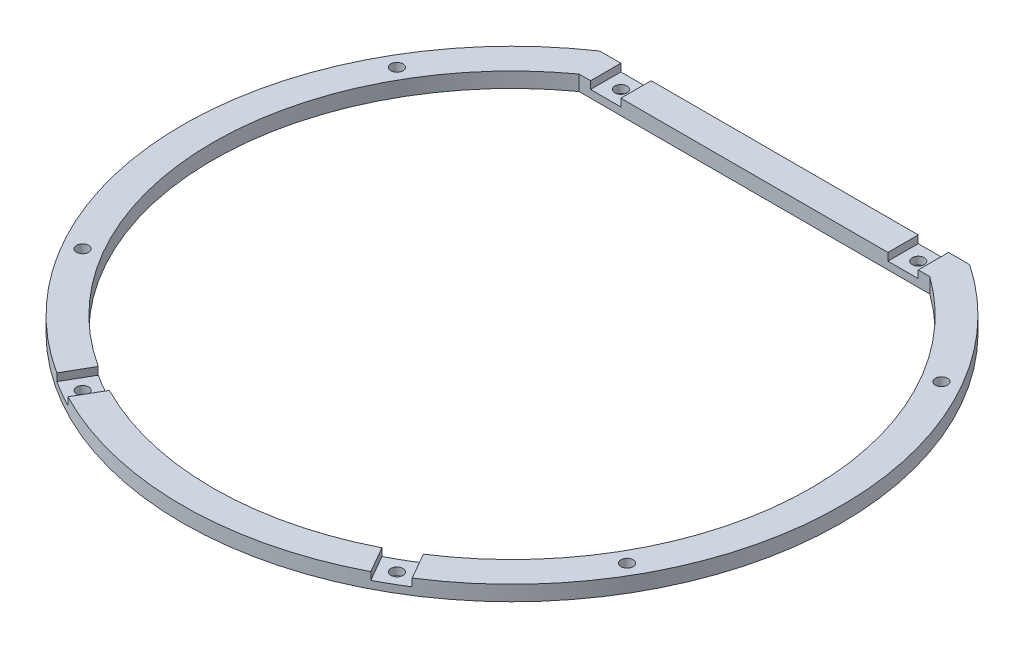
ISO-10303-21;
HEADER;
FILE_DESCRIPTION(('STEP AP214'),'2;1');
FILE_NAME('part.step','',(''),(''),'','','');
FILE_SCHEMA(('AUTOMOTIVE_DESIGN { 1 0 10303 214 1 1 1 1 }'));
ENDSEC;
DATA;
#1=APPLICATION_CONTEXT('core data for automotive mechanical design processes');
#2=APPLICATION_PROTOCOL_DEFINITION('international standard','automotive_design',2000,#1);
#3=PRODUCT_CONTEXT('',#1,'mechanical');
#4=PRODUCT('Part','Part','',(#3));
#5=PRODUCT_RELATED_PRODUCT_CATEGORY('part','',(#4));
#6=PRODUCT_DEFINITION_FORMATION('','',#4);
#7=PRODUCT_DEFINITION_CONTEXT('part definition',#1,'design');
#8=PRODUCT_DEFINITION('design','',#6,#7);
#9=PRODUCT_DEFINITION_SHAPE('','',#8);
#10=(LENGTH_UNIT() NAMED_UNIT(*) SI_UNIT(.MILLI.,.METRE.));
#11=(NAMED_UNIT(*) PLANE_ANGLE_UNIT() SI_UNIT($,.RADIAN.));
#12=(NAMED_UNIT(*) SI_UNIT($,.STERADIAN.) SOLID_ANGLE_UNIT());
#13=UNCERTAINTY_MEASURE_WITH_UNIT(LENGTH_MEASURE(1.E-05),#10,'distance_accuracy_value','');
#14=(GEOMETRIC_REPRESENTATION_CONTEXT(3) GLOBAL_UNCERTAINTY_ASSIGNED_CONTEXT((#13)) GLOBAL_UNIT_ASSIGNED_CONTEXT((#10,
#11,#12)) REPRESENTATION_CONTEXT('',''));
#15=CARTESIAN_POINT('',(0.,0.,0.));
#16=DIRECTION('',(0.,0.,1.));
#17=DIRECTION('',(1.,0.,0.));
#18=AXIS2_PLACEMENT_3D('',#15,#16,#17);
#19=CARTESIAN_POINT('',(0.,4.,0.));
#20=DIRECTION('',(0.,1.,0.));
#21=DIRECTION('',(0.,0.,1.));
#22=AXIS2_PLACEMENT_3D('',#19,#20,#21);
#23=PLANE('',#22);
#24=CARTESIAN_POINT('',(0.,4.,0.));
#25=DIRECTION('',(0.,1.,0.));
#26=DIRECTION('',(0.,0.,1.));
#27=AXIS2_PLACEMENT_3D('',#24,#25,#26);
#28=CIRCLE('',#27,87.);
#29=CARTESIAN_POINT('',(-39.9898970501174,4.,77.2645334802522));
#30=VERTEX_POINT('',#29);
#31=CARTESIAN_POINT('',(39.9898970501174,4.,77.2645334802522));
#32=VERTEX_POINT('',#31);
#33=EDGE_CURVE('E228',#30,#32,#28,.T.);
#34=ORIENTED_EDGE('',*,*,#33,.T.);
#35=DIRECTION('',(-0.5,0.,-0.866025403784439));
#36=VECTOR('',#35,1.);
#37=CARTESIAN_POINT('',(27.5180265038248,4.,55.6626200286515));
#38=LINE('',#37,#36);
#39=CARTESIAN_POINT('',(35.985232980011,4.,70.3282518435823));
#40=VERTEX_POINT('',#39);
#41=EDGE_CURVE('E181',#32,#40,#38,.T.);
#42=ORIENTED_EDGE('',*,*,#41,.T.);
#43=CARTESIAN_POINT('',(0.,4.,0.));
#44=DIRECTION('',(0.,1.,0.));
#45=DIRECTION('',(0.,0.,1.));
#46=AXIS2_PLACEMENT_3D('',#43,#44,#45);
#47=CIRCLE('',#46,79.);
#48=CARTESIAN_POINT('',(-35.985232980011,4.,70.3282518435823));
#49=VERTEX_POINT('',#48);
#50=EDGE_CURVE('E197',#49,#40,#47,.T.);
#51=ORIENTED_EDGE('',*,*,#50,.F.);
#52=DIRECTION('',(0.5,0.,-0.866025403784439));
#53=VECTOR('',#52,1.);
#54=CARTESIAN_POINT('',(-27.5180265038248,4.,55.6626200286515));
#55=LINE('',#54,#53);
#56=EDGE_CURVE('E268',#30,#49,#55,.T.);
#57=ORIENTED_EDGE('',*,*,#56,.F.);
#58=EDGE_LOOP('',(#34,#42,#51,#57));
#59=FACE_BOUND('',#58,.T.);
#60=ADVANCED_FACE('F35',(#59),#23,.T.);
#61=CARTESIAN_POINT('',(71.8801085141087,4.,41.4999999999996));
#62=DIRECTION('',(0.,1.,0.));
#63=DIRECTION('',(0.,0.,1.));
#64=AXIS2_PLACEMENT_3D('',#61,#62,#63);
#65=CIRCLE('',#64,1.6);
#66=CARTESIAN_POINT('',(71.8801085141087,4.,43.0999999999996));
#67=VERTEX_POINT('',#66);
#68=EDGE_CURVE('E475',#67,#67,#65,.T.);
#69=ORIENTED_EDGE('',*,*,#68,.F.);
#70=EDGE_LOOP('',(#69));
#71=FACE_BOUND('',#70,.T.);
#72=CARTESIAN_POINT('',(71.8801085141084,4.,-41.5000000000001));
#73=DIRECTION('',(0.,1.,0.));
#74=DIRECTION('',(0.,0.,1.));
#75=AXIS2_PLACEMENT_3D('',#72,#73,#74);
#76=CIRCLE('',#75,1.6);
#77=CARTESIAN_POINT('',(71.8801085141084,4.,-39.9000000000001));
#78=VERTEX_POINT('',#77);
#79=EDGE_CURVE('E500',#78,#78,#76,.T.);
#80=ORIENTED_EDGE('',*,*,#79,.F.);
#81=EDGE_LOOP('',(#80));
#82=FACE_BOUND('',#81,.T.);
#83=CARTESIAN_POINT('',(42.9134362102865,4.,66.3282518435822));
#84=VERTEX_POINT('',#83);
#85=CARTESIAN_POINT('',(46.3141447076376,4.,-64.));
#86=VERTEX_POINT('',#85);
#87=EDGE_CURVE('E188',#84,#86,#47,.T.);
#88=ORIENTED_EDGE('',*,*,#87,.F.);
#89=DIRECTION('',(0.499999999999999,0.,0.866025403784439));
#90=VECTOR('',#89,1.);
#91=CARTESIAN_POINT('',(53.7582256102105,4.,85.1119780816351));
#92=LINE('',#91,#90);
#93=CARTESIAN_POINT('',(46.9181002803929,4.,73.2645334802522));
#94=VERTEX_POINT('',#93);
#95=EDGE_CURVE('E172',#84,#94,#92,.T.);
#96=ORIENTED_EDGE('',*,*,#95,.T.);
#97=CARTESIAN_POINT('',(48.8364617882991,4.,-72.));
#98=VERTEX_POINT('',#97);
#99=EDGE_CURVE('E229',#94,#98,#28,.T.);
#100=ORIENTED_EDGE('',*,*,#99,.T.);
#101=DIRECTION('',(-1.,0.,0.));
#102=VECTOR('',#101,1.);
#103=CARTESIAN_POINT('',(-48.8364617882991,4.,-72.));
#104=LINE('',#103,#102);
#105=CARTESIAN_POINT('',(43.2598183048943,4.,-72.));
#106=VERTEX_POINT('',#105);
#107=EDGE_CURVE('E230',#98,#106,#104,.T.);
#108=ORIENTED_EDGE('',*,*,#107,.T.);
#109=DIRECTION('',(0.,0.,-1.));
#110=VECTOR('',#109,1.);
#111=CARTESIAN_POINT('',(43.2598183048943,4.,-64.));
#112=LINE('',#111,#110);
#113=CARTESIAN_POINT('',(43.2598183048943,4.,-64.));
#114=VERTEX_POINT('',#113);
#115=EDGE_CURVE('E292',#114,#106,#112,.T.);
#116=ORIENTED_EDGE('',*,*,#115,.F.);
#117=DIRECTION('',(-1.,0.,0.));
#118=VECTOR('',#117,1.);
#119=CARTESIAN_POINT('',(-46.3141447076377,4.,-64.));
#120=LINE('',#119,#118);
#121=EDGE_CURVE('E196',#86,#114,#120,.T.);
#122=ORIENTED_EDGE('',*,*,#121,.F.);
#123=EDGE_LOOP('',(#88,#96,#100,#108,#116,#122));
#124=FACE_BOUND('',#123,.T.);
#125=ADVANCED_FACE('F193',(#71,#82,#124),#23,.T.);
#126=CARTESIAN_POINT('',(0.,4.,0.));
#127=DIRECTION('',(0.,-1.,0.));
#128=DIRECTION('',(0.,0.,-1.));
#129=AXIS2_PLACEMENT_3D('',#126,#127,#128);
#130=CYLINDRICAL_SURFACE('',#129,87.);
#131=DIRECTION('',(0.,-1.,0.));
#132=VECTOR('',#131,1.);
#133=CARTESIAN_POINT('',(39.9898970501174,4.,77.2645334802522));
#134=LINE('',#133,#132);
#135=CARTESIAN_POINT('',(39.9898970501174,2.,77.2645334802522));
#136=VERTEX_POINT('',#135);
#137=EDGE_CURVE('E259',#32,#136,#134,.T.);
#138=ORIENTED_EDGE('',*,*,#137,.F.);
#139=ORIENTED_EDGE('',*,*,#33,.F.);
#140=DIRECTION('',(0.,-1.,0.));
#141=VECTOR('',#140,1.);
#142=CARTESIAN_POINT('',(-39.9898970501174,4.,77.2645334802522));
#143=LINE('',#142,#141);
#144=CARTESIAN_POINT('',(-39.9898970501174,2.,77.2645334802522));
#145=VERTEX_POINT('',#144);
#146=EDGE_CURVE('E286',#30,#145,#143,.T.);
#147=ORIENTED_EDGE('',*,*,#146,.T.);
#148=CARTESIAN_POINT('',(0.,2.,0.));
#149=DIRECTION('',(0.,-1.,0.));
#150=DIRECTION('',(0.,0.,-1.));
#151=AXIS2_PLACEMENT_3D('',#148,#149,#150);
#152=CIRCLE('',#151,87.);
#153=CARTESIAN_POINT('',(-46.9181002803929,2.,73.2645334802522));
#154=VERTEX_POINT('',#153);
#155=EDGE_CURVE('E281',#145,#154,#152,.T.);
#156=ORIENTED_EDGE('',*,*,#155,.T.);
#157=DIRECTION('',(0.,-1.,0.));
#158=VECTOR('',#157,1.);
#159=CARTESIAN_POINT('',(-46.9181002803929,4.,73.2645334802522));
#160=LINE('',#159,#158);
#161=CARTESIAN_POINT('',(-46.9181002803929,4.,73.2645334802522));
#162=VERTEX_POINT('',#161);
#163=EDGE_CURVE('E289',#154,#162,#160,.F.);
#164=ORIENTED_EDGE('',*,*,#163,.T.);
#165=CARTESIAN_POINT('',(-48.8364617882991,4.,-72.));
#166=VERTEX_POINT('',#165);
#167=EDGE_CURVE('E224',#166,#162,#28,.T.);
#168=ORIENTED_EDGE('',*,*,#167,.F.);
#169=DIRECTION('',(0.,-1.,0.));
#170=VECTOR('',#169,1.);
#171=CARTESIAN_POINT('',(-48.8364617882991,4.,-72.));
#172=LINE('',#171,#170);
#173=CARTESIAN_POINT('',(-48.8364617882991,0.,-72.));
#174=VERTEX_POINT('',#173);
#175=EDGE_CURVE('E233',#166,#174,#172,.T.);
#176=ORIENTED_EDGE('',*,*,#175,.T.);
#177=CARTESIAN_POINT('',(0.,0.,0.));
#178=DIRECTION('',(0.,1.,0.));
#179=DIRECTION('',(0.,0.,1.));
#180=AXIS2_PLACEMENT_3D('',#177,#178,#179);
#181=CIRCLE('',#180,87.);
#182=CARTESIAN_POINT('',(48.8364617882991,0.,-72.));
#183=VERTEX_POINT('',#182);
#184=EDGE_CURVE('E221',#174,#183,#181,.T.);
#185=ORIENTED_EDGE('',*,*,#184,.T.);
#186=DIRECTION('',(0.,-1.,0.));
#187=VECTOR('',#186,1.);
#188=CARTESIAN_POINT('',(48.8364617882991,4.,-72.));
#189=LINE('',#188,#187);
#190=EDGE_CURVE('E241',#98,#183,#189,.T.);
#191=ORIENTED_EDGE('',*,*,#190,.F.);
#192=ORIENTED_EDGE('',*,*,#99,.F.);
#193=DIRECTION('',(0.,-1.,0.));
#194=VECTOR('',#193,1.);
#195=CARTESIAN_POINT('',(46.9181002803929,4.,73.2645334802522));
#196=LINE('',#195,#194);
#197=CARTESIAN_POINT('',(46.9181002803929,2.,73.2645334802522));
#198=VERTEX_POINT('',#197);
#199=EDGE_CURVE('E177',#198,#94,#196,.F.);
#200=ORIENTED_EDGE('',*,*,#199,.F.);
#201=CARTESIAN_POINT('',(0.,2.,0.));
#202=DIRECTION('',(0.,-1.,0.));
#203=DIRECTION('',(0.,0.,-1.));
#204=AXIS2_PLACEMENT_3D('',#201,#202,#203);
#205=CIRCLE('',#204,87.);
#206=EDGE_CURVE('E260',#198,#136,#205,.T.);
#207=ORIENTED_EDGE('',*,*,#206,.T.);
#208=EDGE_LOOP('',(#138,#139,#147,#156,#164,#168,#176,#185,#191,#192,#200,#207));
#209=FACE_BOUND('',#208,.T.);
#210=ADVANCED_FACE('F37',(#209),#130,.T.);
#211=CARTESIAN_POINT('',(0.,4.,0.));
#212=DIRECTION('',(0.,-1.,0.));
#213=DIRECTION('',(0.,0.,-1.));
#214=AXIS2_PLACEMENT_3D('',#211,#212,#213);
#215=CYLINDRICAL_SURFACE('',#214,79.);
#216=ORIENTED_EDGE('',*,*,#50,.T.);
#217=DIRECTION('',(0.,-1.,0.));
#218=VECTOR('',#217,1.);
#219=CARTESIAN_POINT('',(35.985232980011,4.,70.3282518435823));
#220=LINE('',#219,#218);
#221=CARTESIAN_POINT('',(35.985232980011,2.,70.3282518435823));
#222=VERTEX_POINT('',#221);
#223=EDGE_CURVE('E11',#40,#222,#220,.T.);
#224=ORIENTED_EDGE('',*,*,#223,.T.);
#225=CARTESIAN_POINT('',(0.,2.,0.));
#226=DIRECTION('',(0.,-1.,0.));
#227=DIRECTION('',(0.,0.,-1.));
#228=AXIS2_PLACEMENT_3D('',#225,#226,#227);
#229=CIRCLE('',#228,79.);
#230=CARTESIAN_POINT('',(42.9134362102865,2.,66.3282518435822));
#231=VERTEX_POINT('',#230);
#232=EDGE_CURVE('E190',#231,#222,#229,.T.);
#233=ORIENTED_EDGE('',*,*,#232,.F.);
#234=DIRECTION('',(0.,-1.,0.));
#235=VECTOR('',#234,1.);
#236=CARTESIAN_POINT('',(42.9134362102865,4.,66.3282518435823));
#237=LINE('',#236,#235);
#238=EDGE_CURVE('E44',#231,#84,#237,.F.);
#239=ORIENTED_EDGE('',*,*,#238,.T.);
#240=ORIENTED_EDGE('',*,*,#87,.T.);
#241=DIRECTION('',(0.,-1.,0.));
#242=VECTOR('',#241,1.);
#243=CARTESIAN_POINT('',(46.3141447076376,4.,-64.));
#244=LINE('',#243,#242);
#245=CARTESIAN_POINT('',(46.3141447076376,0.,-64.));
#246=VERTEX_POINT('',#245);
#247=EDGE_CURVE('E219',#86,#246,#244,.T.);
#248=ORIENTED_EDGE('',*,*,#247,.T.);
#249=CARTESIAN_POINT('',(0.,0.,0.));
#250=DIRECTION('',(0.,1.,0.));
#251=DIRECTION('',(0.,0.,1.));
#252=AXIS2_PLACEMENT_3D('',#249,#250,#251);
#253=CIRCLE('',#252,79.);
#254=CARTESIAN_POINT('',(-46.3141447076377,0.,-64.));
#255=VERTEX_POINT('',#254);
#256=EDGE_CURVE('E202',#255,#246,#253,.T.);
#257=ORIENTED_EDGE('',*,*,#256,.F.);
#258=DIRECTION('',(0.,-1.,0.));
#259=VECTOR('',#258,1.);
#260=CARTESIAN_POINT('',(-46.3141447076377,4.,-64.));
#261=LINE('',#260,#259);
#262=CARTESIAN_POINT('',(-46.3141447076377,4.,-64.));
#263=VERTEX_POINT('',#262);
#264=EDGE_CURVE('E217',#263,#255,#261,.T.);
#265=ORIENTED_EDGE('',*,*,#264,.F.);
#266=CARTESIAN_POINT('',(-42.9134362102865,4.,66.3282518435822));
#267=VERTEX_POINT('',#266);
#268=EDGE_CURVE('E200',#263,#267,#47,.T.);
#269=ORIENTED_EDGE('',*,*,#268,.T.);
#270=DIRECTION('',(0.,-1.,0.));
#271=VECTOR('',#270,1.);
#272=CARTESIAN_POINT('',(-42.9134362102865,4.,66.3282518435823));
#273=LINE('',#272,#271);
#274=CARTESIAN_POINT('',(-42.9134362102865,2.,66.3282518435822));
#275=VERTEX_POINT('',#274);
#276=EDGE_CURVE('E248',#275,#267,#273,.F.);
#277=ORIENTED_EDGE('',*,*,#276,.F.);
#278=CARTESIAN_POINT('',(0.,2.,0.));
#279=DIRECTION('',(0.,-1.,0.));
#280=DIRECTION('',(0.,0.,-1.));
#281=AXIS2_PLACEMENT_3D('',#278,#279,#280);
#282=CIRCLE('',#281,79.);
#283=CARTESIAN_POINT('',(-35.985232980011,2.,70.3282518435823));
#284=VERTEX_POINT('',#283);
#285=EDGE_CURVE('E244',#284,#275,#282,.T.);
#286=ORIENTED_EDGE('',*,*,#285,.F.);
#287=DIRECTION('',(0.,-1.,0.));
#288=VECTOR('',#287,1.);
#289=CARTESIAN_POINT('',(-35.985232980011,4.,70.3282518435823));
#290=LINE('',#289,#288);
#291=EDGE_CURVE('E246',#49,#284,#290,.T.);
#292=ORIENTED_EDGE('',*,*,#291,.F.);
#293=EDGE_LOOP('',(#216,#224,#233,#239,#240,#248,#257,#265,#269,#277,#286,#292));
#294=FACE_BOUND('',#293,.T.);
#295=ADVANCED_FACE('F186',(#294),#215,.F.);
#296=CARTESIAN_POINT('',(-71.8801085141087,4.,-41.4999999999996));
#297=DIRECTION('',(0.,1.,0.));
#298=DIRECTION('',(0.,0.,1.));
#299=AXIS2_PLACEMENT_3D('',#296,#297,#298);
#300=CIRCLE('',#299,1.6);
#301=CARTESIAN_POINT('',(-71.8801085141087,4.,-39.8999999999996));
#302=VERTEX_POINT('',#301);
#303=EDGE_CURVE('E488',#302,#302,#300,.T.);
#304=ORIENTED_EDGE('',*,*,#303,.F.);
#305=EDGE_LOOP('',(#304));
#306=FACE_BOUND('',#305,.T.);
#307=CARTESIAN_POINT('',(-71.8801085141084,4.,41.5000000000001));
#308=DIRECTION('',(0.,1.,0.));
#309=DIRECTION('',(0.,0.,1.));
#310=AXIS2_PLACEMENT_3D('',#307,#308,#309);
#311=CIRCLE('',#310,1.6);
#312=CARTESIAN_POINT('',(-71.8801085141084,4.,43.1000000000001));
#313=VERTEX_POINT('',#312);
#314=EDGE_CURVE('E494',#313,#313,#311,.T.);
#315=ORIENTED_EDGE('',*,*,#314,.F.);
#316=EDGE_LOOP('',(#315));
#317=FACE_BOUND('',#316,.T.);
#318=DIRECTION('',(-0.499999999999999,0.,0.866025403784439));
#319=VECTOR('',#318,1.);
#320=CARTESIAN_POINT('',(-53.7582256102105,4.,85.1119780816351));
#321=LINE('',#320,#319);
#322=EDGE_CURVE('E278',#267,#162,#321,.T.);
#323=ORIENTED_EDGE('',*,*,#322,.F.);
#324=ORIENTED_EDGE('',*,*,#268,.F.);
#325=CARTESIAN_POINT('',(-43.259818304895,4.,-64.));
#326=VERTEX_POINT('',#325);
#327=EDGE_CURVE('E207',#326,#263,#120,.T.);
#328=ORIENTED_EDGE('',*,*,#327,.F.);
#329=DIRECTION('',(0.,0.,1.));
#330=VECTOR('',#329,1.);
#331=CARTESIAN_POINT('',(-43.259818304895,4.,-64.));
#332=LINE('',#331,#330);
#333=CARTESIAN_POINT('',(-43.259818304895,4.,-72.));
#334=VERTEX_POINT('',#333);
#335=EDGE_CURVE('E322',#334,#326,#332,.T.);
#336=ORIENTED_EDGE('',*,*,#335,.F.);
#337=EDGE_CURVE('E227',#334,#166,#104,.T.);
#338=ORIENTED_EDGE('',*,*,#337,.T.);
#339=ORIENTED_EDGE('',*,*,#167,.T.);
#340=EDGE_LOOP('',(#323,#324,#328,#336,#338,#339));
#341=FACE_BOUND('',#340,.T.);
#342=ADVANCED_FACE('F366',(#306,#317,#341),#23,.T.);
#343=DIRECTION('',(0.,0.,1.));
#344=VECTOR('',#343,1.);
#345=CARTESIAN_POINT('',(35.2598183048943,4.,-64.));
#346=LINE('',#345,#344);
#347=CARTESIAN_POINT('',(35.2598183048943,4.,-72.));
#348=VERTEX_POINT('',#347);
#349=CARTESIAN_POINT('',(35.2598183048943,4.,-64.));
#350=VERTEX_POINT('',#349);
#351=EDGE_CURVE('E297',#348,#350,#346,.T.);
#352=ORIENTED_EDGE('',*,*,#351,.F.);
#353=CARTESIAN_POINT('',(-35.259818304895,4.,-72.));
#354=VERTEX_POINT('',#353);
#355=EDGE_CURVE('E234',#348,#354,#104,.T.);
#356=ORIENTED_EDGE('',*,*,#355,.T.);
#357=DIRECTION('',(0.,0.,-1.));
#358=VECTOR('',#357,1.);
#359=CARTESIAN_POINT('',(-35.259818304895,4.,-64.));
#360=LINE('',#359,#358);
#361=CARTESIAN_POINT('',(-35.259818304895,4.,-64.));
#362=VERTEX_POINT('',#361);
#363=EDGE_CURVE('E310',#362,#354,#360,.T.);
#364=ORIENTED_EDGE('',*,*,#363,.F.);
#365=EDGE_CURVE('E211',#350,#362,#120,.T.);
#366=ORIENTED_EDGE('',*,*,#365,.F.);
#367=EDGE_LOOP('',(#352,#356,#364,#366));
#368=FACE_BOUND('',#367,.T.);
#369=ADVANCED_FACE('F360',(#368),#23,.T.);
#370=CARTESIAN_POINT('',(0.,0.,0.));
#371=DIRECTION('',(0.,1.,0.));
#372=DIRECTION('',(0.,0.,1.));
#373=AXIS2_PLACEMENT_3D('',#370,#371,#372);
#374=PLANE('',#373);
#375=CARTESIAN_POINT('',(71.8801085141087,0.,41.4999999999996));
#376=DIRECTION('',(0.,1.,0.));
#377=DIRECTION('',(0.,0.,1.));
#378=AXIS2_PLACEMENT_3D('',#375,#376,#377);
#379=CIRCLE('',#378,1.6);
#380=CARTESIAN_POINT('',(71.8801085141087,0.,43.0999999999996));
#381=VERTEX_POINT('',#380);
#382=EDGE_CURVE('E472',#381,#381,#379,.T.);
#383=ORIENTED_EDGE('',*,*,#382,.T.);
#384=EDGE_LOOP('',(#383));
#385=FACE_BOUND('',#384,.T.);
#386=CARTESIAN_POINT('',(41.5000000000003,0.,71.8801085141082));
#387=DIRECTION('',(0.,1.,0.));
#388=DIRECTION('',(0.,0.,1.));
#389=AXIS2_PLACEMENT_3D('',#386,#387,#388);
#390=CIRCLE('',#389,1.6);
#391=CARTESIAN_POINT('',(41.5000000000003,0.,73.4801085141082));
#392=VERTEX_POINT('',#391);
#393=EDGE_CURVE('E477',#392,#392,#390,.T.);
#394=ORIENTED_EDGE('',*,*,#393,.T.);
#395=EDGE_LOOP('',(#394));
#396=FACE_BOUND('',#395,.T.);
#397=CARTESIAN_POINT('',(-41.4999999999998,0.,71.8801085141085));
#398=DIRECTION('',(0.,1.,0.));
#399=DIRECTION('',(0.,0.,1.));
#400=AXIS2_PLACEMENT_3D('',#397,#398,#399);
#401=CIRCLE('',#400,1.6);
#402=CARTESIAN_POINT('',(-41.4999999999998,0.,73.4801085141085));
#403=VERTEX_POINT('',#402);
#404=EDGE_CURVE('E485',#403,#403,#401,.T.);
#405=ORIENTED_EDGE('',*,*,#404,.T.);
#406=EDGE_LOOP('',(#405));
#407=FACE_BOUND('',#406,.T.);
#408=CARTESIAN_POINT('',(-71.8801085141087,0.,-41.4999999999996));
#409=DIRECTION('',(0.,1.,0.));
#410=DIRECTION('',(0.,0.,1.));
#411=AXIS2_PLACEMENT_3D('',#408,#409,#410);
#412=CIRCLE('',#411,1.6);
#413=CARTESIAN_POINT('',(-71.8801085141087,0.,-39.8999999999996));
#414=VERTEX_POINT('',#413);
#415=EDGE_CURVE('E491',#414,#414,#412,.T.);
#416=ORIENTED_EDGE('',*,*,#415,.T.);
#417=EDGE_LOOP('',(#416));
#418=FACE_BOUND('',#417,.T.);
#419=CARTESIAN_POINT('',(-71.8801085141084,0.,41.5000000000001));
#420=DIRECTION('',(0.,1.,0.));
#421=DIRECTION('',(0.,0.,1.));
#422=AXIS2_PLACEMENT_3D('',#419,#420,#421);
#423=CIRCLE('',#422,1.6);
#424=CARTESIAN_POINT('',(-71.8801085141084,0.,43.1000000000001));
#425=VERTEX_POINT('',#424);
#426=EDGE_CURVE('E497',#425,#425,#423,.T.);
#427=ORIENTED_EDGE('',*,*,#426,.T.);
#428=EDGE_LOOP('',(#427));
#429=FACE_BOUND('',#428,.T.);
#430=CARTESIAN_POINT('',(71.8801085141084,0.,-41.5000000000001));
#431=DIRECTION('',(0.,1.,0.));
#432=DIRECTION('',(0.,0.,1.));
#433=AXIS2_PLACEMENT_3D('',#430,#431,#432);
#434=CIRCLE('',#433,1.6);
#435=CARTESIAN_POINT('',(71.8801085141084,0.,-39.9000000000001));
#436=VERTEX_POINT('',#435);
#437=EDGE_CURVE('E503',#436,#436,#434,.T.);
#438=ORIENTED_EDGE('',*,*,#437,.T.);
#439=EDGE_LOOP('',(#438));
#440=FACE_BOUND('',#439,.T.);
#441=CARTESIAN_POINT('',(-39.259818304895,0.,-68.));
#442=DIRECTION('',(0.,1.,0.));
#443=DIRECTION('',(0.,0.,1.));
#444=AXIS2_PLACEMENT_3D('',#441,#442,#443);
#445=CIRCLE('',#444,1.6);
#446=CARTESIAN_POINT('',(-39.259818304895,0.,-66.4));
#447=VERTEX_POINT('',#446);
#448=EDGE_CURVE('E506',#447,#447,#445,.T.);
#449=ORIENTED_EDGE('',*,*,#448,.T.);
#450=EDGE_LOOP('',(#449));
#451=FACE_BOUND('',#450,.T.);
#452=CARTESIAN_POINT('',(39.2598183048943,0.,-68.));
#453=DIRECTION('',(0.,1.,0.));
#454=DIRECTION('',(0.,0.,1.));
#455=AXIS2_PLACEMENT_3D('',#452,#453,#454);
#456=CIRCLE('',#455,1.6);
#457=CARTESIAN_POINT('',(39.2598183048943,0.,-66.4));
#458=VERTEX_POINT('',#457);
#459=EDGE_CURVE('E512',#458,#458,#456,.T.);
#460=ORIENTED_EDGE('',*,*,#459,.T.);
#461=EDGE_LOOP('',(#460));
#462=FACE_BOUND('',#461,.T.);
#463=ORIENTED_EDGE('',*,*,#184,.F.);
#464=DIRECTION('',(-1.,0.,0.));
#465=VECTOR('',#464,1.);
#466=CARTESIAN_POINT('',(-48.8364617882991,0.,-72.));
#467=LINE('',#466,#465);
#468=EDGE_CURVE('E237',#183,#174,#467,.T.);
#469=ORIENTED_EDGE('',*,*,#468,.F.);
#470=EDGE_LOOP('',(#463,#469));
#471=FACE_BOUND('',#470,.T.);
#472=ORIENTED_EDGE('',*,*,#256,.T.);
#473=DIRECTION('',(-1.,0.,0.));
#474=VECTOR('',#473,1.);
#475=CARTESIAN_POINT('',(-46.3141447076377,0.,-64.));
#476=LINE('',#475,#474);
#477=EDGE_CURVE('E198',#246,#255,#476,.T.);
#478=ORIENTED_EDGE('',*,*,#477,.T.);
#479=EDGE_LOOP('',(#472,#478));
#480=FACE_BOUND('',#479,.T.);
#481=ADVANCED_FACE('F379',(#385,#396,#407,#418,#429,#440,#451,#462,#471,#480),#374,.F.);
#482=CARTESIAN_POINT('',(-48.8364617882991,4.,-72.));
#483=DIRECTION('',(0.,0.,1.));
#484=DIRECTION('',(1.,0.,0.));
#485=AXIS2_PLACEMENT_3D('',#482,#483,#484);
#486=PLANE('',#485);
#487=DIRECTION('',(-1.,0.,0.));
#488=VECTOR('',#487,1.);
#489=CARTESIAN_POINT('',(35.2598183048943,2.,-72.));
#490=LINE('',#489,#488);
#491=CARTESIAN_POINT('',(43.2598183048943,2.,-72.));
#492=VERTEX_POINT('',#491);
#493=CARTESIAN_POINT('',(35.2598183048943,2.,-72.));
#494=VERTEX_POINT('',#493);
#495=EDGE_CURVE('E296',#492,#494,#490,.T.);
#496=ORIENTED_EDGE('',*,*,#495,.F.);
#497=DIRECTION('',(0.,1.,0.));
#498=VECTOR('',#497,1.);
#499=CARTESIAN_POINT('',(43.2598183048943,2.,-72.));
#500=LINE('',#499,#498);
#501=EDGE_CURVE('E305',#492,#106,#500,.T.);
#502=ORIENTED_EDGE('',*,*,#501,.T.);
#503=ORIENTED_EDGE('',*,*,#107,.F.);
#504=ORIENTED_EDGE('',*,*,#190,.T.);
#505=ORIENTED_EDGE('',*,*,#468,.T.);
#506=ORIENTED_EDGE('',*,*,#175,.F.);
#507=ORIENTED_EDGE('',*,*,#337,.F.);
#508=DIRECTION('',(0.,1.,0.));
#509=VECTOR('',#508,1.);
#510=CARTESIAN_POINT('',(-43.259818304895,2.,-72.));
#511=LINE('',#510,#509);
#512=CARTESIAN_POINT('',(-43.259818304895,2.,-72.));
#513=VERTEX_POINT('',#512);
#514=EDGE_CURVE('E339',#513,#334,#511,.T.);
#515=ORIENTED_EDGE('',*,*,#514,.F.);
#516=DIRECTION('',(-1.,0.,0.));
#517=VECTOR('',#516,1.);
#518=CARTESIAN_POINT('',(-43.259818304895,2.,-72.));
#519=LINE('',#518,#517);
#520=CARTESIAN_POINT('',(-35.259818304895,2.,-72.));
#521=VERTEX_POINT('',#520);
#522=EDGE_CURVE('E321',#521,#513,#519,.T.);
#523=ORIENTED_EDGE('',*,*,#522,.F.);
#524=DIRECTION('',(0.,1.,0.));
#525=VECTOR('',#524,1.);
#526=CARTESIAN_POINT('',(-35.259818304895,2.,-72.));
#527=LINE('',#526,#525);
#528=EDGE_CURVE('E330',#521,#354,#527,.T.);
#529=ORIENTED_EDGE('',*,*,#528,.T.);
#530=ORIENTED_EDGE('',*,*,#355,.F.);
#531=DIRECTION('',(0.,1.,0.));
#532=VECTOR('',#531,1.);
#533=CARTESIAN_POINT('',(35.2598183048943,2.,-72.));
#534=LINE('',#533,#532);
#535=EDGE_CURVE('E314',#494,#348,#534,.T.);
#536=ORIENTED_EDGE('',*,*,#535,.F.);
#537=EDGE_LOOP('',(#496,#502,#503,#504,#505,#506,#507,#515,#523,#529,#530,#536));
#538=FACE_BOUND('',#537,.T.);
#539=ADVANCED_FACE('F345',(#538),#486,.F.);
#540=CARTESIAN_POINT('',(-46.3141447076377,4.,-64.));
#541=DIRECTION('',(0.,0.,1.));
#542=DIRECTION('',(1.,0.,0.));
#543=AXIS2_PLACEMENT_3D('',#540,#541,#542);
#544=PLANE('',#543);
#545=DIRECTION('',(0.,1.,0.));
#546=VECTOR('',#545,1.);
#547=CARTESIAN_POINT('',(43.2598183048943,2.,-64.));
#548=LINE('',#547,#546);
#549=CARTESIAN_POINT('',(43.2598183048943,2.,-64.));
#550=VERTEX_POINT('',#549);
#551=EDGE_CURVE('E308',#550,#114,#548,.T.);
#552=ORIENTED_EDGE('',*,*,#551,.F.);
#553=DIRECTION('',(1.,0.,0.));
#554=VECTOR('',#553,1.);
#555=CARTESIAN_POINT('',(35.2598183048943,2.,-64.));
#556=LINE('',#555,#554);
#557=CARTESIAN_POINT('',(35.2598183048943,2.,-64.));
#558=VERTEX_POINT('',#557);
#559=EDGE_CURVE('E302',#558,#550,#556,.T.);
#560=ORIENTED_EDGE('',*,*,#559,.F.);
#561=DIRECTION('',(0.,1.,0.));
#562=VECTOR('',#561,1.);
#563=CARTESIAN_POINT('',(35.2598183048943,2.,-64.));
#564=LINE('',#563,#562);
#565=EDGE_CURVE('E311',#558,#350,#564,.T.);
#566=ORIENTED_EDGE('',*,*,#565,.T.);
#567=ORIENTED_EDGE('',*,*,#365,.T.);
#568=DIRECTION('',(0.,1.,0.));
#569=VECTOR('',#568,1.);
#570=CARTESIAN_POINT('',(-35.259818304895,2.,-64.));
#571=LINE('',#570,#569);
#572=CARTESIAN_POINT('',(-35.259818304895,2.,-64.));
#573=VERTEX_POINT('',#572);
#574=EDGE_CURVE('E334',#573,#362,#571,.T.);
#575=ORIENTED_EDGE('',*,*,#574,.F.);
#576=DIRECTION('',(1.,0.,0.));
#577=VECTOR('',#576,1.);
#578=CARTESIAN_POINT('',(-43.259818304895,2.,-64.));
#579=LINE('',#578,#577);
#580=CARTESIAN_POINT('',(-43.259818304895,2.,-64.));
#581=VERTEX_POINT('',#580);
#582=EDGE_CURVE('E327',#581,#573,#579,.T.);
#583=ORIENTED_EDGE('',*,*,#582,.F.);
#584=DIRECTION('',(0.,1.,0.));
#585=VECTOR('',#584,1.);
#586=CARTESIAN_POINT('',(-43.259818304895,2.,-64.));
#587=LINE('',#586,#585);
#588=EDGE_CURVE('E337',#581,#326,#587,.T.);
#589=ORIENTED_EDGE('',*,*,#588,.T.);
#590=ORIENTED_EDGE('',*,*,#327,.T.);
#591=ORIENTED_EDGE('',*,*,#264,.T.);
#592=ORIENTED_EDGE('',*,*,#477,.F.);
#593=ORIENTED_EDGE('',*,*,#247,.F.);
#594=ORIENTED_EDGE('',*,*,#121,.T.);
#595=EDGE_LOOP('',(#552,#560,#566,#567,#575,#583,#589,#590,#591,#592,#593,#594));
#596=FACE_BOUND('',#595,.T.);
#597=ADVANCED_FACE('F356',(#596),#544,.T.);
#598=CARTESIAN_POINT('',(-35.259818304895,2.,-64.));
#599=DIRECTION('',(1.,0.,0.));
#600=DIRECTION('',(0.,0.,-1.));
#601=AXIS2_PLACEMENT_3D('',#598,#599,#600);
#602=PLANE('',#601);
#603=ORIENTED_EDGE('',*,*,#363,.T.);
#604=ORIENTED_EDGE('',*,*,#528,.F.);
#605=DIRECTION('',(0.,0.,-1.));
#606=VECTOR('',#605,1.);
#607=CARTESIAN_POINT('',(-35.259818304895,2.,-64.));
#608=LINE('',#607,#606);
#609=EDGE_CURVE('E318',#573,#521,#608,.T.);
#610=ORIENTED_EDGE('',*,*,#609,.F.);
#611=ORIENTED_EDGE('',*,*,#574,.T.);
#612=EDGE_LOOP('',(#603,#604,#610,#611));
#613=FACE_BOUND('',#612,.T.);
#614=ADVANCED_FACE('F349',(#613),#602,.F.);
#615=CARTESIAN_POINT('',(-43.259818304895,2.,-64.));
#616=DIRECTION('',(-1.,0.,0.));
#617=DIRECTION('',(0.,0.,1.));
#618=AXIS2_PLACEMENT_3D('',#615,#616,#617);
#619=PLANE('',#618);
#620=ORIENTED_EDGE('',*,*,#335,.T.);
#621=ORIENTED_EDGE('',*,*,#588,.F.);
#622=DIRECTION('',(0.,0.,1.));
#623=VECTOR('',#622,1.);
#624=CARTESIAN_POINT('',(-43.259818304895,2.,-64.));
#625=LINE('',#624,#623);
#626=EDGE_CURVE('E325',#513,#581,#625,.T.);
#627=ORIENTED_EDGE('',*,*,#626,.F.);
#628=ORIENTED_EDGE('',*,*,#514,.T.);
#629=EDGE_LOOP('',(#620,#621,#627,#628));
#630=FACE_BOUND('',#629,.T.);
#631=ADVANCED_FACE('F404',(#630),#619,.F.);
#632=CARTESIAN_POINT('',(0.,2.,0.));
#633=DIRECTION('',(0.,-1.,0.));
#634=DIRECTION('',(0.,0.,-1.));
#635=AXIS2_PLACEMENT_3D('',#632,#633,#634);
#636=PLANE('',#635);
#637=CARTESIAN_POINT('',(-39.259818304895,2.,-68.));
#638=DIRECTION('',(0.,-1.,0.));
#639=DIRECTION('',(0.,0.,-1.));
#640=AXIS2_PLACEMENT_3D('',#637,#638,#639);
#641=CIRCLE('',#640,1.6);
#642=CARTESIAN_POINT('',(-39.259818304895,2.,-69.6));
#643=VERTEX_POINT('',#642);
#644=EDGE_CURVE('E509',#643,#643,#641,.T.);
#645=ORIENTED_EDGE('',*,*,#644,.T.);
#646=EDGE_LOOP('',(#645));
#647=FACE_BOUND('',#646,.T.);
#648=ORIENTED_EDGE('',*,*,#609,.T.);
#649=ORIENTED_EDGE('',*,*,#522,.T.);
#650=ORIENTED_EDGE('',*,*,#626,.T.);
#651=ORIENTED_EDGE('',*,*,#582,.T.);
#652=EDGE_LOOP('',(#648,#649,#650,#651));
#653=FACE_BOUND('',#652,.T.);
#654=ADVANCED_FACE('F352',(#647,#653),#636,.F.);
#655=CARTESIAN_POINT('',(43.2598183048943,2.,-64.));
#656=DIRECTION('',(1.,0.,0.));
#657=DIRECTION('',(0.,0.,-1.));
#658=AXIS2_PLACEMENT_3D('',#655,#656,#657);
#659=PLANE('',#658);
#660=ORIENTED_EDGE('',*,*,#115,.T.);
#661=ORIENTED_EDGE('',*,*,#501,.F.);
#662=DIRECTION('',(0.,0.,-1.));
#663=VECTOR('',#662,1.);
#664=CARTESIAN_POINT('',(43.2598183048943,2.,-64.));
#665=LINE('',#664,#663);
#666=EDGE_CURVE('E293',#550,#492,#665,.T.);
#667=ORIENTED_EDGE('',*,*,#666,.F.);
#668=ORIENTED_EDGE('',*,*,#551,.T.);
#669=EDGE_LOOP('',(#660,#661,#667,#668));
#670=FACE_BOUND('',#669,.T.);
#671=ADVANCED_FACE('F410',(#670),#659,.F.);
#672=CARTESIAN_POINT('',(35.2598183048943,2.,-64.));
#673=DIRECTION('',(-1.,0.,0.));
#674=DIRECTION('',(0.,0.,1.));
#675=AXIS2_PLACEMENT_3D('',#672,#673,#674);
#676=PLANE('',#675);
#677=ORIENTED_EDGE('',*,*,#351,.T.);
#678=ORIENTED_EDGE('',*,*,#565,.F.);
#679=DIRECTION('',(0.,0.,1.));
#680=VECTOR('',#679,1.);
#681=CARTESIAN_POINT('',(35.2598183048943,2.,-64.));
#682=LINE('',#681,#680);
#683=EDGE_CURVE('E300',#494,#558,#682,.T.);
#684=ORIENTED_EDGE('',*,*,#683,.F.);
#685=ORIENTED_EDGE('',*,*,#535,.T.);
#686=EDGE_LOOP('',(#677,#678,#684,#685));
#687=FACE_BOUND('',#686,.T.);
#688=ADVANCED_FACE('F414',(#687),#676,.F.);
#689=CARTESIAN_POINT('',(0.,2.,0.));
#690=DIRECTION('',(0.,-1.,0.));
#691=DIRECTION('',(0.,0.,-1.));
#692=AXIS2_PLACEMENT_3D('',#689,#690,#691);
#693=PLANE('',#692);
#694=CARTESIAN_POINT('',(39.2598183048943,2.,-68.));
#695=DIRECTION('',(0.,-1.,0.));
#696=DIRECTION('',(0.,0.,-1.));
#697=AXIS2_PLACEMENT_3D('',#694,#695,#696);
#698=CIRCLE('',#697,1.6);
#699=CARTESIAN_POINT('',(39.2598183048943,2.,-69.6));
#700=VERTEX_POINT('',#699);
#701=EDGE_CURVE('E182',#700,#700,#698,.T.);
#702=ORIENTED_EDGE('',*,*,#701,.T.);
#703=EDGE_LOOP('',(#702));
#704=FACE_BOUND('',#703,.T.);
#705=ORIENTED_EDGE('',*,*,#666,.T.);
#706=ORIENTED_EDGE('',*,*,#495,.T.);
#707=ORIENTED_EDGE('',*,*,#683,.T.);
#708=ORIENTED_EDGE('',*,*,#559,.T.);
#709=EDGE_LOOP('',(#705,#706,#707,#708));
#710=FACE_BOUND('',#709,.T.);
#711=ADVANCED_FACE('F418',(#704,#710),#693,.F.);
#712=CARTESIAN_POINT('',(-53.7582256102105,2.,85.1119780816351));
#713=DIRECTION('',(-0.866025403784439,0.,-0.5));
#714=DIRECTION('',(-0.5,0.,0.866025403784439));
#715=AXIS2_PLACEMENT_3D('',#712,#713,#714);
#716=PLANE('',#715);
#717=DIRECTION('',(-0.499999999999999,0.,0.866025403784439));
#718=VECTOR('',#717,1.);
#719=CARTESIAN_POINT('',(-53.7582256102105,2.,85.1119780816351));
#720=LINE('',#719,#718);
#721=EDGE_CURVE('E277',#275,#154,#720,.T.);
#722=ORIENTED_EDGE('',*,*,#721,.F.);
#723=ORIENTED_EDGE('',*,*,#276,.T.);
#724=ORIENTED_EDGE('',*,*,#322,.T.);
#725=ORIENTED_EDGE('',*,*,#163,.F.);
#726=EDGE_LOOP('',(#722,#723,#724,#725));
#727=FACE_BOUND('',#726,.T.);
#728=ADVANCED_FACE('F372',(#727),#716,.F.);
#729=CARTESIAN_POINT('',(-27.5180265038248,2.,55.6626200286515));
#730=DIRECTION('',(0.866025403784439,0.,0.5));
#731=DIRECTION('',(0.5,0.,-0.866025403784439));
#732=AXIS2_PLACEMENT_3D('',#729,#730,#731);
#733=PLANE('',#732);
#734=ORIENTED_EDGE('',*,*,#56,.T.);
#735=ORIENTED_EDGE('',*,*,#291,.T.);
#736=DIRECTION('',(0.5,0.,-0.866025403784439));
#737=VECTOR('',#736,1.);
#738=CARTESIAN_POINT('',(-27.5180265038248,2.,55.6626200286515));
#739=LINE('',#738,#737);
#740=EDGE_CURVE('E59',#145,#284,#739,.T.);
#741=ORIENTED_EDGE('',*,*,#740,.F.);
#742=ORIENTED_EDGE('',*,*,#146,.F.);
#743=EDGE_LOOP('',(#734,#735,#741,#742));
#744=FACE_BOUND('',#743,.T.);
#745=ADVANCED_FACE('F375',(#744),#733,.F.);
#746=CARTESIAN_POINT('',(0.,2.,0.));
#747=DIRECTION('',(0.,-1.,0.));
#748=DIRECTION('',(0.,0.,-1.));
#749=AXIS2_PLACEMENT_3D('',#746,#747,#748);
#750=PLANE('',#749);
#751=CARTESIAN_POINT('',(-41.4999999999998,2.,71.8801085141085));
#752=DIRECTION('',(0.,-1.,0.));
#753=DIRECTION('',(0.,0.,-1.));
#754=AXIS2_PLACEMENT_3D('',#751,#752,#753);
#755=CIRCLE('',#754,1.6);
#756=CARTESIAN_POINT('',(-41.4999999999998,2.,70.2801085141085));
#757=VERTEX_POINT('',#756);
#758=EDGE_CURVE('E39',#757,#757,#755,.T.);
#759=ORIENTED_EDGE('',*,*,#758,.T.);
#760=EDGE_LOOP('',(#759));
#761=FACE_BOUND('',#760,.T.);
#762=ORIENTED_EDGE('',*,*,#740,.T.);
#763=ORIENTED_EDGE('',*,*,#285,.T.);
#764=ORIENTED_EDGE('',*,*,#721,.T.);
#765=ORIENTED_EDGE('',*,*,#155,.F.);
#766=EDGE_LOOP('',(#762,#763,#764,#765));
#767=FACE_BOUND('',#766,.T.);
#768=ADVANCED_FACE('F373',(#761,#767),#750,.F.);
#769=CARTESIAN_POINT('',(27.5180265038248,2.,55.6626200286515));
#770=DIRECTION('',(0.866025403784439,0.,-0.5));
#771=DIRECTION('',(-0.5,0.,-0.866025403784439));
#772=AXIS2_PLACEMENT_3D('',#769,#770,#771);
#773=PLANE('',#772);
#774=ORIENTED_EDGE('',*,*,#137,.T.);
#775=DIRECTION('',(-0.5,0.,-0.866025403784439));
#776=VECTOR('',#775,1.);
#777=CARTESIAN_POINT('',(27.5180265038248,2.,55.6626200286515));
#778=LINE('',#777,#776);
#779=EDGE_CURVE('E253',#136,#222,#778,.T.);
#780=ORIENTED_EDGE('',*,*,#779,.T.);
#781=ORIENTED_EDGE('',*,*,#223,.F.);
#782=ORIENTED_EDGE('',*,*,#41,.F.);
#783=EDGE_LOOP('',(#774,#780,#781,#782));
#784=FACE_BOUND('',#783,.T.);
#785=ADVANCED_FACE('F256',(#784),#773,.T.);
#786=CARTESIAN_POINT('',(53.7582256102105,2.,85.1119780816351));
#787=DIRECTION('',(-0.866025403784439,0.,0.5));
#788=DIRECTION('',(0.5,0.,0.866025403784439));
#789=AXIS2_PLACEMENT_3D('',#786,#787,#788);
#790=PLANE('',#789);
#791=ORIENTED_EDGE('',*,*,#199,.T.);
#792=ORIENTED_EDGE('',*,*,#95,.F.);
#793=ORIENTED_EDGE('',*,*,#238,.F.);
#794=DIRECTION('',(0.499999999999999,0.,0.866025403784439));
#795=VECTOR('',#794,1.);
#796=CARTESIAN_POINT('',(53.7582256102105,2.,85.1119780816351));
#797=LINE('',#796,#795);
#798=EDGE_CURVE('E51',#231,#198,#797,.T.);
#799=ORIENTED_EDGE('',*,*,#798,.T.);
#800=EDGE_LOOP('',(#791,#792,#793,#799));
#801=FACE_BOUND('',#800,.T.);
#802=ADVANCED_FACE('F174',(#801),#790,.T.);
#803=CARTESIAN_POINT('',(0.,2.,0.));
#804=DIRECTION('',(0.,-1.,0.));
#805=DIRECTION('',(0.,0.,-1.));
#806=AXIS2_PLACEMENT_3D('',#803,#804,#805);
#807=PLANE('',#806);
#808=CARTESIAN_POINT('',(41.5000000000003,2.,71.8801085141082));
#809=DIRECTION('',(0.,-1.,0.));
#810=DIRECTION('',(0.,0.,-1.));
#811=AXIS2_PLACEMENT_3D('',#808,#809,#810);
#812=CIRCLE('',#811,1.6);
#813=CARTESIAN_POINT('',(41.5000000000003,2.,70.2801085141082));
#814=VERTEX_POINT('',#813);
#815=EDGE_CURVE('E482',#814,#814,#812,.T.);
#816=ORIENTED_EDGE('',*,*,#815,.T.);
#817=EDGE_LOOP('',(#816));
#818=FACE_BOUND('',#817,.T.);
#819=ORIENTED_EDGE('',*,*,#798,.F.);
#820=ORIENTED_EDGE('',*,*,#232,.T.);
#821=ORIENTED_EDGE('',*,*,#779,.F.);
#822=ORIENTED_EDGE('',*,*,#206,.F.);
#823=EDGE_LOOP('',(#819,#820,#821,#822));
#824=FACE_BOUND('',#823,.T.);
#825=ADVANCED_FACE('F252',(#818,#824),#807,.F.);
#826=CARTESIAN_POINT('',(39.2598183048943,4.,-68.));
#827=DIRECTION('',(0.,1.,0.));
#828=DIRECTION('',(0.,0.,1.));
#829=AXIS2_PLACEMENT_3D('',#826,#827,#828);
#830=CYLINDRICAL_SURFACE('',#829,1.6);
#831=ORIENTED_EDGE('',*,*,#459,.F.);
#832=EDGE_LOOP('',(#831));
#833=FACE_BOUND('',#832,.T.);
#834=ORIENTED_EDGE('',*,*,#701,.F.);
#835=EDGE_LOOP('',(#834));
#836=FACE_BOUND('',#835,.T.);
#837=ADVANCED_FACE('F436',(#833,#836),#830,.F.);
#838=CARTESIAN_POINT('',(-39.259818304895,4.,-68.));
#839=DIRECTION('',(0.,1.,0.));
#840=DIRECTION('',(0.,0.,1.));
#841=AXIS2_PLACEMENT_3D('',#838,#839,#840);
#842=CYLINDRICAL_SURFACE('',#841,1.6);
#843=ORIENTED_EDGE('',*,*,#448,.F.);
#844=EDGE_LOOP('',(#843));
#845=FACE_BOUND('',#844,.T.);
#846=ORIENTED_EDGE('',*,*,#644,.F.);
#847=EDGE_LOOP('',(#846));
#848=FACE_BOUND('',#847,.T.);
#849=ADVANCED_FACE('F440',(#845,#848),#842,.F.);
#850=CARTESIAN_POINT('',(71.8801085141084,4.,-41.5000000000001));
#851=DIRECTION('',(0.,1.,0.));
#852=DIRECTION('',(0.,0.,1.));
#853=AXIS2_PLACEMENT_3D('',#850,#851,#852);
#854=CYLINDRICAL_SURFACE('',#853,1.6);
#855=ORIENTED_EDGE('',*,*,#437,.F.);
#856=EDGE_LOOP('',(#855));
#857=FACE_BOUND('',#856,.T.);
#858=ORIENTED_EDGE('',*,*,#79,.T.);
#859=EDGE_LOOP('',(#858));
#860=FACE_BOUND('',#859,.T.);
#861=ADVANCED_FACE('F444',(#857,#860),#854,.F.);
#862=CARTESIAN_POINT('',(-71.8801085141084,4.,41.5000000000001));
#863=DIRECTION('',(0.,1.,0.));
#864=DIRECTION('',(0.,0.,1.));
#865=AXIS2_PLACEMENT_3D('',#862,#863,#864);
#866=CYLINDRICAL_SURFACE('',#865,1.6);
#867=ORIENTED_EDGE('',*,*,#426,.F.);
#868=EDGE_LOOP('',(#867));
#869=FACE_BOUND('',#868,.T.);
#870=ORIENTED_EDGE('',*,*,#314,.T.);
#871=EDGE_LOOP('',(#870));
#872=FACE_BOUND('',#871,.T.);
#873=ADVANCED_FACE('F448',(#869,#872),#866,.F.);
#874=CARTESIAN_POINT('',(-71.8801085141087,4.,-41.4999999999996));
#875=DIRECTION('',(0.,1.,0.));
#876=DIRECTION('',(0.,0.,1.));
#877=AXIS2_PLACEMENT_3D('',#874,#875,#876);
#878=CYLINDRICAL_SURFACE('',#877,1.6);
#879=ORIENTED_EDGE('',*,*,#415,.F.);
#880=EDGE_LOOP('',(#879));
#881=FACE_BOUND('',#880,.T.);
#882=ORIENTED_EDGE('',*,*,#303,.T.);
#883=EDGE_LOOP('',(#882));
#884=FACE_BOUND('',#883,.T.);
#885=ADVANCED_FACE('F452',(#881,#884),#878,.F.);
#886=CARTESIAN_POINT('',(-41.4999999999998,4.,71.8801085141085));
#887=DIRECTION('',(0.,1.,0.));
#888=DIRECTION('',(0.,0.,1.));
#889=AXIS2_PLACEMENT_3D('',#886,#887,#888);
#890=CYLINDRICAL_SURFACE('',#889,1.6);
#891=ORIENTED_EDGE('',*,*,#404,.F.);
#892=EDGE_LOOP('',(#891));
#893=FACE_BOUND('',#892,.T.);
#894=ORIENTED_EDGE('',*,*,#758,.F.);
#895=EDGE_LOOP('',(#894));
#896=FACE_BOUND('',#895,.T.);
#897=ADVANCED_FACE('F456',(#893,#896),#890,.F.);
#898=CARTESIAN_POINT('',(41.5000000000003,4.,71.8801085141082));
#899=DIRECTION('',(0.,1.,0.));
#900=DIRECTION('',(0.,0.,1.));
#901=AXIS2_PLACEMENT_3D('',#898,#899,#900);
#902=CYLINDRICAL_SURFACE('',#901,1.6);
#903=ORIENTED_EDGE('',*,*,#393,.F.);
#904=EDGE_LOOP('',(#903));
#905=FACE_BOUND('',#904,.T.);
#906=ORIENTED_EDGE('',*,*,#815,.F.);
#907=EDGE_LOOP('',(#906));
#908=FACE_BOUND('',#907,.T.);
#909=ADVANCED_FACE('F460',(#905,#908),#902,.F.);
#910=CARTESIAN_POINT('',(71.8801085141087,4.,41.4999999999996));
#911=DIRECTION('',(0.,1.,0.));
#912=DIRECTION('',(0.,0.,1.));
#913=AXIS2_PLACEMENT_3D('',#910,#911,#912);
#914=CYLINDRICAL_SURFACE('',#913,1.6);
#915=ORIENTED_EDGE('',*,*,#382,.F.);
#916=EDGE_LOOP('',(#915));
#917=FACE_BOUND('',#916,.T.);
#918=ORIENTED_EDGE('',*,*,#68,.T.);
#919=EDGE_LOOP('',(#918));
#920=FACE_BOUND('',#919,.T.);
#921=ADVANCED_FACE('F464',(#917,#920),#914,.F.);
#922=CLOSED_SHELL('',(#60,#125,#210,#295,#342,#369,#481,#539,#597,#614,#631,#654,#671,#688,#711,
#728,#745,#768,#785,#802,#825,#837,#849,#861,#873,#885,#897,#909,#921));
#923=MANIFOLD_SOLID_BREP('B2',#922);
#924=ADVANCED_BREP_SHAPE_REPRESENTATION('',(#18,#923),#14);
#925=SHAPE_DEFINITION_REPRESENTATION(#9,#924);
ENDSEC;
END-ISO-10303-21;
